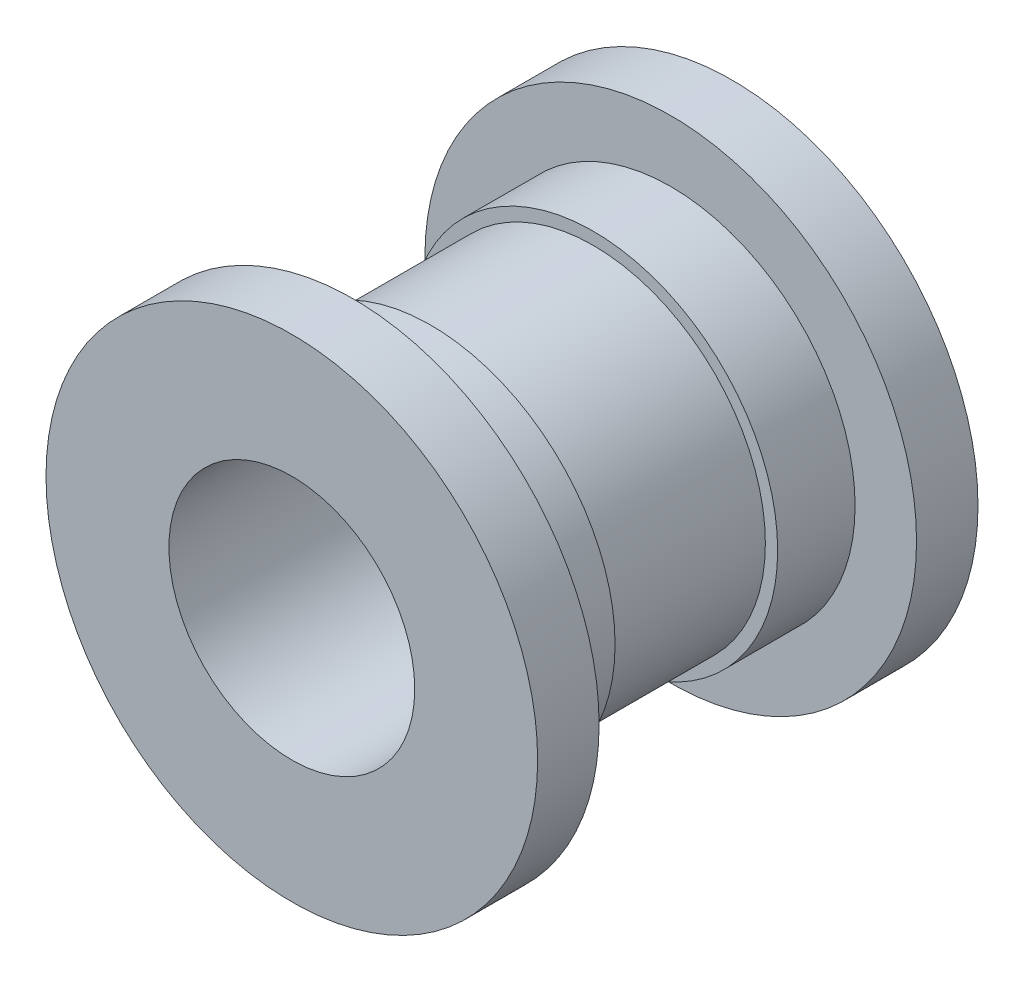
ISO-10303-21;
HEADER;
FILE_DESCRIPTION(('STEP AP214'),'2;1');
FILE_NAME('part.step','',(''),(''),'','','');
FILE_SCHEMA(('AUTOMOTIVE_DESIGN { 1 0 10303 214 1 1 1 1 }'));
ENDSEC;
DATA;
#1=APPLICATION_CONTEXT('core data for automotive mechanical design processes');
#2=APPLICATION_PROTOCOL_DEFINITION('international standard','automotive_design',2000,#1);
#3=PRODUCT_CONTEXT('',#1,'mechanical');
#4=PRODUCT('Part','Part','',(#3));
#5=PRODUCT_RELATED_PRODUCT_CATEGORY('part','',(#4));
#6=PRODUCT_DEFINITION_FORMATION('','',#4);
#7=PRODUCT_DEFINITION_CONTEXT('part definition',#1,'design');
#8=PRODUCT_DEFINITION('design','',#6,#7);
#9=PRODUCT_DEFINITION_SHAPE('','',#8);
#10=(LENGTH_UNIT() NAMED_UNIT(*) SI_UNIT(.MILLI.,.METRE.));
#11=(NAMED_UNIT(*) PLANE_ANGLE_UNIT() SI_UNIT($,.RADIAN.));
#12=(NAMED_UNIT(*) SI_UNIT($,.STERADIAN.) SOLID_ANGLE_UNIT());
#13=UNCERTAINTY_MEASURE_WITH_UNIT(LENGTH_MEASURE(1.E-05),#10,'distance_accuracy_value','');
#14=(GEOMETRIC_REPRESENTATION_CONTEXT(3) GLOBAL_UNCERTAINTY_ASSIGNED_CONTEXT((#13)) GLOBAL_UNIT_ASSIGNED_CONTEXT((#10,
#11,#12)) REPRESENTATION_CONTEXT('',''));
#15=CARTESIAN_POINT('',(0.,0.,0.));
#16=DIRECTION('',(0.,0.,1.));
#17=DIRECTION('',(1.,0.,0.));
#18=AXIS2_PLACEMENT_3D('',#15,#16,#17);
#19=CARTESIAN_POINT('',(0.,0.,2.1));
#20=DIRECTION('',(0.,0.,-1.));
#21=DIRECTION('',(-1.,0.,0.));
#22=AXIS2_PLACEMENT_3D('',#19,#20,#21);
#23=CYLINDRICAL_SURFACE('',#22,4.445);
#24=CARTESIAN_POINT('',(0.,0.,2.1));
#25=DIRECTION('',(0.,0.,1.));
#26=DIRECTION('',(1.,0.,0.));
#27=AXIS2_PLACEMENT_3D('',#24,#25,#26);
#28=CIRCLE('',#27,4.445);
#29=CARTESIAN_POINT('',(4.445,0.,2.1));
#30=VERTEX_POINT('',#29);
#31=EDGE_CURVE('E10',#30,#30,#28,.T.);
#32=ORIENTED_EDGE('',*,*,#31,.F.);
#33=EDGE_LOOP('',(#32));
#34=FACE_BOUND('',#33,.T.);
#35=CARTESIAN_POINT('',(0.,0.,-2.1));
#36=DIRECTION('',(0.,0.,-1.));
#37=DIRECTION('',(-1.,0.,0.));
#38=AXIS2_PLACEMENT_3D('',#35,#36,#37);
#39=CIRCLE('',#38,4.445);
#40=CARTESIAN_POINT('',(-4.445,0.,-2.1));
#41=VERTEX_POINT('',#40);
#42=EDGE_CURVE('E60',#41,#41,#39,.T.);
#43=ORIENTED_EDGE('',*,*,#42,.F.);
#44=EDGE_LOOP('',(#43));
#45=FACE_BOUND('',#44,.T.);
#46=ADVANCED_FACE('F34',(#34,#45),#23,.T.);
#47=CARTESIAN_POINT('',(0.,0.,2.1));
#48=DIRECTION('',(0.,0.,1.));
#49=DIRECTION('',(1.,0.,0.));
#50=AXIS2_PLACEMENT_3D('',#47,#48,#49);
#51=PLANE('',#50);
#52=CARTESIAN_POINT('',(0.,0.,2.1));
#53=DIRECTION('',(0.,0.,1.));
#54=DIRECTION('',(1.,0.,0.));
#55=AXIS2_PLACEMENT_3D('',#52,#53,#54);
#56=CIRCLE('',#55,4.7625);
#57=CARTESIAN_POINT('',(4.7625,0.,2.1));
#58=VERTEX_POINT('',#57);
#59=EDGE_CURVE('E48',#58,#58,#56,.T.);
#60=ORIENTED_EDGE('',*,*,#59,.F.);
#61=EDGE_LOOP('',(#60));
#62=FACE_BOUND('',#61,.T.);
#63=ORIENTED_EDGE('',*,*,#31,.T.);
#64=EDGE_LOOP('',(#63));
#65=FACE_BOUND('',#64,.T.);
#66=ADVANCED_FACE('F120',(#62,#65),#51,.F.);
#67=CARTESIAN_POINT('',(0.,0.,4.1));
#68=DIRECTION('',(0.,0.,-1.));
#69=DIRECTION('',(-1.,0.,0.));
#70=AXIS2_PLACEMENT_3D('',#67,#68,#69);
#71=CYLINDRICAL_SURFACE('',#70,4.7625);
#72=CARTESIAN_POINT('',(0.,0.,4.1));
#73=DIRECTION('',(0.,0.,1.));
#74=DIRECTION('',(1.,0.,0.));
#75=AXIS2_PLACEMENT_3D('',#72,#73,#74);
#76=CIRCLE('',#75,4.7625);
#77=CARTESIAN_POINT('',(4.7625,0.,4.1));
#78=VERTEX_POINT('',#77);
#79=EDGE_CURVE('E41',#78,#78,#76,.T.);
#80=ORIENTED_EDGE('',*,*,#79,.F.);
#81=EDGE_LOOP('',(#80));
#82=FACE_BOUND('',#81,.T.);
#83=ORIENTED_EDGE('',*,*,#59,.T.);
#84=EDGE_LOOP('',(#83));
#85=FACE_BOUND('',#84,.T.);
#86=ADVANCED_FACE('F115',(#82,#85),#71,.T.);
#87=CARTESIAN_POINT('',(0.,0.,4.1));
#88=DIRECTION('',(0.,0.,1.));
#89=DIRECTION('',(1.,0.,0.));
#90=AXIS2_PLACEMENT_3D('',#87,#88,#89);
#91=PLANE('',#90);
#92=CARTESIAN_POINT('',(0.,0.,4.1));
#93=DIRECTION('',(0.,0.,1.));
#94=DIRECTION('',(1.,0.,0.));
#95=AXIS2_PLACEMENT_3D('',#92,#93,#94);
#96=CIRCLE('',#95,6.35);
#97=CARTESIAN_POINT('',(6.35,0.,4.1));
#98=VERTEX_POINT('',#97);
#99=EDGE_CURVE('E57',#98,#98,#96,.T.);
#100=ORIENTED_EDGE('',*,*,#99,.F.);
#101=EDGE_LOOP('',(#100));
#102=FACE_BOUND('',#101,.T.);
#103=ORIENTED_EDGE('',*,*,#79,.T.);
#104=EDGE_LOOP('',(#103));
#105=FACE_BOUND('',#104,.T.);
#106=ADVANCED_FACE('F110',(#102,#105),#91,.F.);
#107=CARTESIAN_POINT('',(0.,0.,5.6875));
#108=DIRECTION('',(0.,0.,-1.));
#109=DIRECTION('',(-1.,0.,0.));
#110=AXIS2_PLACEMENT_3D('',#107,#108,#109);
#111=CYLINDRICAL_SURFACE('',#110,6.35);
#112=CARTESIAN_POINT('',(0.,0.,5.6875));
#113=DIRECTION('',(0.,0.,1.));
#114=DIRECTION('',(1.,0.,0.));
#115=AXIS2_PLACEMENT_3D('',#112,#113,#114);
#116=CIRCLE('',#115,6.35);
#117=CARTESIAN_POINT('',(6.35,0.,5.6875));
#118=VERTEX_POINT('',#117);
#119=EDGE_CURVE('E55',#118,#118,#116,.T.);
#120=ORIENTED_EDGE('',*,*,#119,.F.);
#121=EDGE_LOOP('',(#120));
#122=FACE_BOUND('',#121,.T.);
#123=ORIENTED_EDGE('',*,*,#99,.T.);
#124=EDGE_LOOP('',(#123));
#125=FACE_BOUND('',#124,.T.);
#126=ADVANCED_FACE('F104',(#122,#125),#111,.T.);
#127=CARTESIAN_POINT('',(0.,0.,5.6875));
#128=DIRECTION('',(0.,0.,1.));
#129=DIRECTION('',(1.,0.,0.));
#130=AXIS2_PLACEMENT_3D('',#127,#128,#129);
#131=PLANE('',#130);
#132=CARTESIAN_POINT('',(0.,0.,5.6875));
#133=DIRECTION('',(0.,0.,1.));
#134=DIRECTION('',(1.,0.,0.));
#135=AXIS2_PLACEMENT_3D('',#132,#133,#134);
#136=CIRCLE('',#135,3.175);
#137=CARTESIAN_POINT('',(3.175,0.,5.6875));
#138=VERTEX_POINT('',#137);
#139=EDGE_CURVE('E82',#138,#138,#136,.T.);
#140=ORIENTED_EDGE('',*,*,#139,.F.);
#141=EDGE_LOOP('',(#140));
#142=FACE_BOUND('',#141,.T.);
#143=ORIENTED_EDGE('',*,*,#119,.T.);
#144=EDGE_LOOP('',(#143));
#145=FACE_BOUND('',#144,.T.);
#146=ADVANCED_FACE('F100',(#142,#145),#131,.T.);
#147=CARTESIAN_POINT('',(0.,0.,-2.1));
#148=DIRECTION('',(0.,0.,-1.));
#149=DIRECTION('',(1.,0.,0.));
#150=AXIS2_PLACEMENT_3D('',#147,#148,#149);
#151=PLANE('',#150);
#152=CARTESIAN_POINT('',(0.,0.,-2.1));
#153=DIRECTION('',(0.,0.,1.));
#154=DIRECTION('',(1.,0.,0.));
#155=AXIS2_PLACEMENT_3D('',#152,#153,#154);
#156=CIRCLE('',#155,4.7625);
#157=CARTESIAN_POINT('',(4.7625,0.,-2.1));
#158=VERTEX_POINT('',#157);
#159=EDGE_CURVE('E66',#158,#158,#156,.T.);
#160=ORIENTED_EDGE('',*,*,#159,.T.);
#161=EDGE_LOOP('',(#160));
#162=FACE_BOUND('',#161,.T.);
#163=ORIENTED_EDGE('',*,*,#42,.T.);
#164=EDGE_LOOP('',(#163));
#165=FACE_BOUND('',#164,.T.);
#166=ADVANCED_FACE('F103',(#162,#165),#151,.F.);
#167=CARTESIAN_POINT('',(0.,0.,-4.1));
#168=DIRECTION('',(0.,0.,1.));
#169=DIRECTION('',(1.,0.,0.));
#170=AXIS2_PLACEMENT_3D('',#167,#168,#169);
#171=CYLINDRICAL_SURFACE('',#170,4.7625);
#172=CARTESIAN_POINT('',(0.,0.,-4.1));
#173=DIRECTION('',(0.,0.,-1.));
#174=DIRECTION('',(-1.,0.,0.));
#175=AXIS2_PLACEMENT_3D('',#172,#173,#174);
#176=CIRCLE('',#175,4.7625);
#177=CARTESIAN_POINT('',(-4.7625,0.,-4.1));
#178=VERTEX_POINT('',#177);
#179=EDGE_CURVE('E69',#178,#178,#176,.F.);
#180=ORIENTED_EDGE('',*,*,#179,.T.);
#181=EDGE_LOOP('',(#180));
#182=FACE_BOUND('',#181,.T.);
#183=ORIENTED_EDGE('',*,*,#159,.F.);
#184=EDGE_LOOP('',(#183));
#185=FACE_BOUND('',#184,.T.);
#186=ADVANCED_FACE('F133',(#182,#185),#171,.T.);
#187=CARTESIAN_POINT('',(0.,0.,-5.6875));
#188=DIRECTION('',(0.,0.,1.));
#189=DIRECTION('',(1.,0.,0.));
#190=AXIS2_PLACEMENT_3D('',#187,#188,#189);
#191=CYLINDRICAL_SURFACE('',#190,6.35);
#192=CARTESIAN_POINT('',(0.,0.,-5.6875));
#193=DIRECTION('',(0.,0.,1.));
#194=DIRECTION('',(1.,0.,0.));
#195=AXIS2_PLACEMENT_3D('',#192,#193,#194);
#196=CIRCLE('',#195,6.35);
#197=CARTESIAN_POINT('',(6.35,0.,-5.6875));
#198=VERTEX_POINT('',#197);
#199=EDGE_CURVE('E73',#198,#198,#196,.T.);
#200=ORIENTED_EDGE('',*,*,#199,.T.);
#201=EDGE_LOOP('',(#200));
#202=FACE_BOUND('',#201,.T.);
#203=CARTESIAN_POINT('',(0.,0.,-4.1));
#204=DIRECTION('',(0.,0.,1.));
#205=DIRECTION('',(1.,0.,0.));
#206=AXIS2_PLACEMENT_3D('',#203,#204,#205);
#207=CIRCLE('',#206,6.35);
#208=CARTESIAN_POINT('',(6.35,0.,-4.1));
#209=VERTEX_POINT('',#208);
#210=EDGE_CURVE('E74',#209,#209,#207,.T.);
#211=ORIENTED_EDGE('',*,*,#210,.F.);
#212=EDGE_LOOP('',(#211));
#213=FACE_BOUND('',#212,.T.);
#214=ADVANCED_FACE('F139',(#202,#213),#191,.T.);
#215=CARTESIAN_POINT('',(0.,0.,-5.6875));
#216=DIRECTION('',(0.,0.,-1.));
#217=DIRECTION('',(1.,0.,0.));
#218=AXIS2_PLACEMENT_3D('',#215,#216,#217);
#219=PLANE('',#218);
#220=CARTESIAN_POINT('',(0.,0.,-5.6875));
#221=DIRECTION('',(0.,0.,1.));
#222=DIRECTION('',(1.,0.,0.));
#223=AXIS2_PLACEMENT_3D('',#220,#221,#222);
#224=CIRCLE('',#223,3.175);
#225=CARTESIAN_POINT('',(3.175,0.,-5.6875));
#226=VERTEX_POINT('',#225);
#227=EDGE_CURVE('E78',#226,#226,#224,.T.);
#228=ORIENTED_EDGE('',*,*,#227,.T.);
#229=EDGE_LOOP('',(#228));
#230=FACE_BOUND('',#229,.T.);
#231=ORIENTED_EDGE('',*,*,#199,.F.);
#232=EDGE_LOOP('',(#231));
#233=FACE_BOUND('',#232,.T.);
#234=ADVANCED_FACE('F90',(#230,#233),#219,.T.);
#235=CARTESIAN_POINT('',(0.,0.,-4.1));
#236=DIRECTION('',(0.,0.,-1.));
#237=DIRECTION('',(1.,0.,0.));
#238=AXIS2_PLACEMENT_3D('',#235,#236,#237);
#239=PLANE('',#238);
#240=ORIENTED_EDGE('',*,*,#179,.F.);
#241=EDGE_LOOP('',(#240));
#242=FACE_BOUND('',#241,.T.);
#243=ORIENTED_EDGE('',*,*,#210,.T.);
#244=EDGE_LOOP('',(#243));
#245=FACE_BOUND('',#244,.T.);
#246=ADVANCED_FACE('F96',(#242,#245),#239,.F.);
#247=CARTESIAN_POINT('',(0.,0.,-5.6875));
#248=DIRECTION('',(0.,0.,1.));
#249=DIRECTION('',(1.,0.,0.));
#250=AXIS2_PLACEMENT_3D('',#247,#248,#249);
#251=CYLINDRICAL_SURFACE('',#250,3.175);
#252=ORIENTED_EDGE('',*,*,#227,.F.);
#253=EDGE_LOOP('',(#252));
#254=FACE_BOUND('',#253,.T.);
#255=ORIENTED_EDGE('',*,*,#139,.T.);
#256=EDGE_LOOP('',(#255));
#257=FACE_BOUND('',#256,.T.);
#258=ADVANCED_FACE('F93',(#254,#257),#251,.F.);
#259=CLOSED_SHELL('',(#46,#66,#86,#106,#126,#146,#166,#186,#214,#234,#246,#258));
#260=MANIFOLD_SOLID_BREP('B2',#259);
#261=ADVANCED_BREP_SHAPE_REPRESENTATION('',(#18,#260),#14);
#262=SHAPE_DEFINITION_REPRESENTATION(#9,#261);
ENDSEC;
END-ISO-10303-21;
